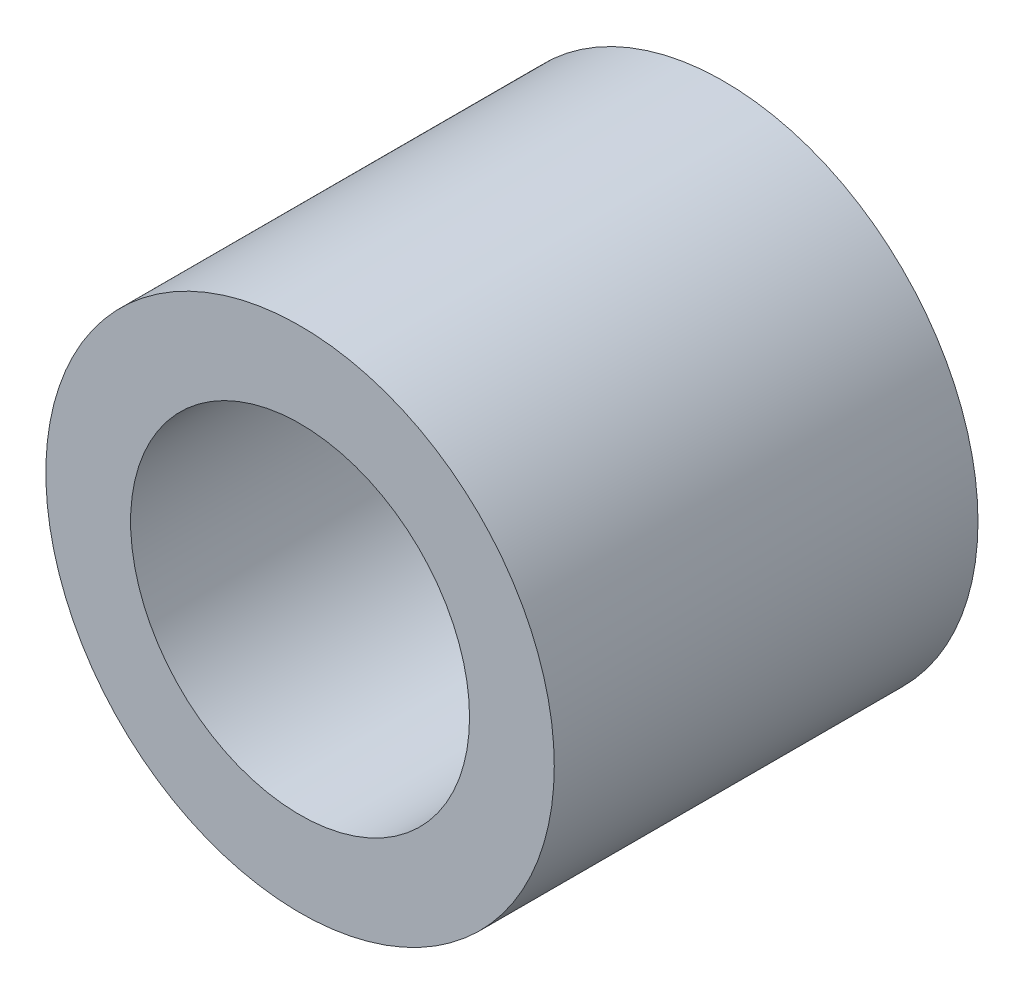
ISO-10303-21;
HEADER;
FILE_DESCRIPTION(('STEP AP214'),'2;1');
FILE_NAME('part.step','',(''),(''),'','','');
FILE_SCHEMA(('AUTOMOTIVE_DESIGN { 1 0 10303 214 1 1 1 1 }'));
ENDSEC;
DATA;
#1=APPLICATION_CONTEXT('core data for automotive mechanical design processes');
#2=APPLICATION_PROTOCOL_DEFINITION('international standard','automotive_design',2000,#1);
#3=PRODUCT_CONTEXT('',#1,'mechanical');
#4=PRODUCT('Part','Part','',(#3));
#5=PRODUCT_RELATED_PRODUCT_CATEGORY('part','',(#4));
#6=PRODUCT_DEFINITION_FORMATION('','',#4);
#7=PRODUCT_DEFINITION_CONTEXT('part definition',#1,'design');
#8=PRODUCT_DEFINITION('design','',#6,#7);
#9=PRODUCT_DEFINITION_SHAPE('','',#8);
#10=(LENGTH_UNIT() NAMED_UNIT(*) SI_UNIT(.MILLI.,.METRE.));
#11=(NAMED_UNIT(*) PLANE_ANGLE_UNIT() SI_UNIT($,.RADIAN.));
#12=(NAMED_UNIT(*) SI_UNIT($,.STERADIAN.) SOLID_ANGLE_UNIT());
#13=UNCERTAINTY_MEASURE_WITH_UNIT(LENGTH_MEASURE(1.E-05),#10,'distance_accuracy_value','');
#14=(GEOMETRIC_REPRESENTATION_CONTEXT(3) GLOBAL_UNCERTAINTY_ASSIGNED_CONTEXT((#13)) GLOBAL_UNIT_ASSIGNED_CONTEXT((#10,
#11,#12)) REPRESENTATION_CONTEXT('',''));
#15=CARTESIAN_POINT('',(0.,0.,0.));
#16=DIRECTION('',(0.,0.,1.));
#17=DIRECTION('',(1.,0.,0.));
#18=AXIS2_PLACEMENT_3D('',#15,#16,#17);
#19=CARTESIAN_POINT('',(14.4914484165324,-8.84819118762842,10.));
#20=DIRECTION('',(0.,0.,1.));
#21=DIRECTION('',(1.,0.,0.));
#22=AXIS2_PLACEMENT_3D('',#19,#20,#21);
#23=PLANE('',#22);
#24=CARTESIAN_POINT('',(14.4914484165324,-8.84819118762842,10.));
#25=DIRECTION('',(0.,0.,1.));
#26=DIRECTION('',(1.,0.,0.));
#27=AXIS2_PLACEMENT_3D('',#24,#25,#26);
#28=CIRCLE('',#27,6.);
#29=CARTESIAN_POINT('',(20.4914484165324,-8.84819118762842,10.));
#30=VERTEX_POINT('',#29);
#31=EDGE_CURVE('E10',#30,#30,#28,.T.);
#32=ORIENTED_EDGE('',*,*,#31,.T.);
#33=EDGE_LOOP('',(#32));
#34=FACE_BOUND('',#33,.T.);
#35=CARTESIAN_POINT('',(14.4914484165324,-8.84819118762842,10.));
#36=DIRECTION('',(0.,0.,1.));
#37=DIRECTION('',(1.,0.,0.));
#38=AXIS2_PLACEMENT_3D('',#35,#36,#37);
#39=CIRCLE('',#38,4.);
#40=CARTESIAN_POINT('',(18.4914484165324,-8.84819118762842,10.));
#41=VERTEX_POINT('',#40);
#42=EDGE_CURVE('E42',#41,#41,#39,.T.);
#43=ORIENTED_EDGE('',*,*,#42,.F.);
#44=EDGE_LOOP('',(#43));
#45=FACE_BOUND('',#44,.T.);
#46=ADVANCED_FACE('F31',(#34,#45),#23,.T.);
#47=CARTESIAN_POINT('',(14.4914484165324,-8.84819118762842,0.));
#48=DIRECTION('',(0.,0.,1.));
#49=DIRECTION('',(1.,0.,0.));
#50=AXIS2_PLACEMENT_3D('',#47,#48,#49);
#51=PLANE('',#50);
#52=CARTESIAN_POINT('',(14.4914484165324,-8.84819118762842,0.));
#53=DIRECTION('',(0.,0.,1.));
#54=DIRECTION('',(1.,0.,0.));
#55=AXIS2_PLACEMENT_3D('',#52,#53,#54);
#56=CIRCLE('',#55,6.);
#57=CARTESIAN_POINT('',(20.4914484165324,-8.84819118762842,0.));
#58=VERTEX_POINT('',#57);
#59=EDGE_CURVE('E35',#58,#58,#56,.T.);
#60=ORIENTED_EDGE('',*,*,#59,.F.);
#61=EDGE_LOOP('',(#60));
#62=FACE_BOUND('',#61,.T.);
#63=CARTESIAN_POINT('',(14.4914484165324,-8.84819118762842,0.));
#64=DIRECTION('',(0.,0.,1.));
#65=DIRECTION('',(1.,0.,0.));
#66=AXIS2_PLACEMENT_3D('',#63,#64,#65);
#67=CIRCLE('',#66,4.);
#68=CARTESIAN_POINT('',(18.4914484165324,-8.84819118762842,0.));
#69=VERTEX_POINT('',#68);
#70=EDGE_CURVE('E44',#69,#69,#67,.T.);
#71=ORIENTED_EDGE('',*,*,#70,.T.);
#72=EDGE_LOOP('',(#71));
#73=FACE_BOUND('',#72,.T.);
#74=ADVANCED_FACE('F54',(#62,#73),#51,.F.);
#75=CARTESIAN_POINT('',(14.4914484165324,-8.84819118762842,10.));
#76=DIRECTION('',(0.,0.,-1.));
#77=DIRECTION('',(-1.,0.,0.));
#78=AXIS2_PLACEMENT_3D('',#75,#76,#77);
#79=CYLINDRICAL_SURFACE('',#78,6.);
#80=ORIENTED_EDGE('',*,*,#31,.F.);
#81=EDGE_LOOP('',(#80));
#82=FACE_BOUND('',#81,.T.);
#83=ORIENTED_EDGE('',*,*,#59,.T.);
#84=EDGE_LOOP('',(#83));
#85=FACE_BOUND('',#84,.T.);
#86=ADVANCED_FACE('F33',(#82,#85),#79,.T.);
#87=CARTESIAN_POINT('',(14.4914484165324,-8.84819118762842,10.));
#88=DIRECTION('',(0.,0.,-1.));
#89=DIRECTION('',(-1.,0.,0.));
#90=AXIS2_PLACEMENT_3D('',#87,#88,#89);
#91=CYLINDRICAL_SURFACE('',#90,4.);
#92=ORIENTED_EDGE('',*,*,#42,.T.);
#93=EDGE_LOOP('',(#92));
#94=FACE_BOUND('',#93,.T.);
#95=ORIENTED_EDGE('',*,*,#70,.F.);
#96=EDGE_LOOP('',(#95));
#97=FACE_BOUND('',#96,.T.);
#98=ADVANCED_FACE('F50',(#94,#97),#91,.F.);
#99=CLOSED_SHELL('',(#46,#74,#86,#98));
#100=MANIFOLD_SOLID_BREP('B2',#99);
#101=ADVANCED_BREP_SHAPE_REPRESENTATION('',(#18,#100),#14);
#102=SHAPE_DEFINITION_REPRESENTATION(#9,#101);
ENDSEC;
END-ISO-10303-21;
